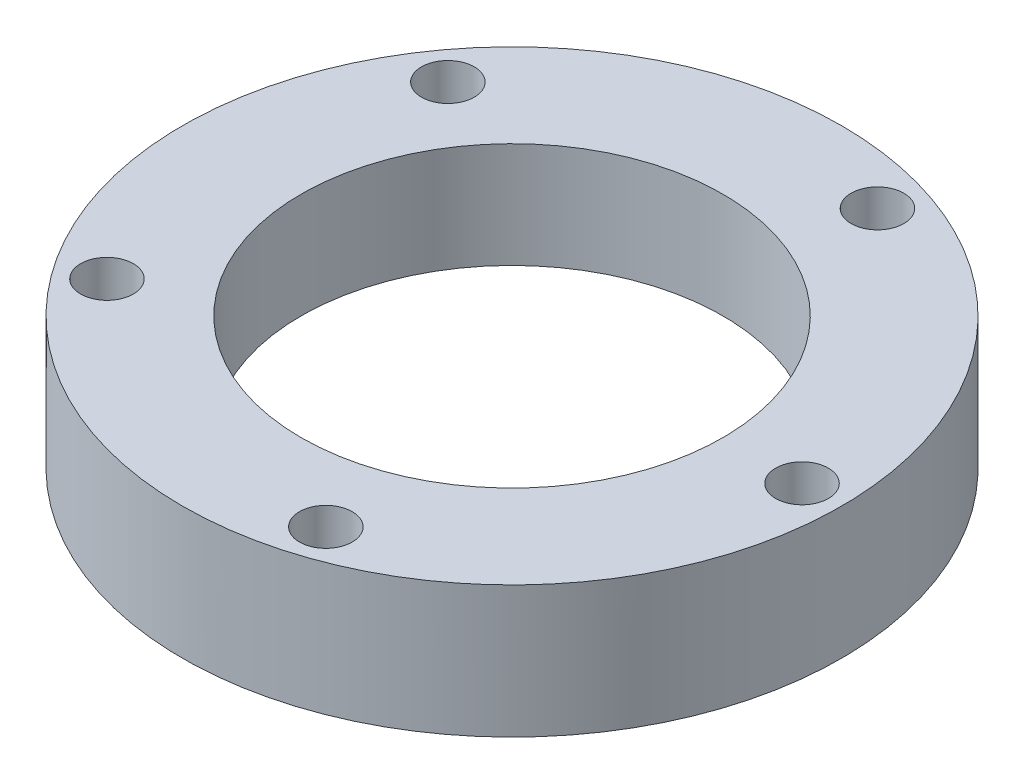
ISO-10303-21;
HEADER;
FILE_DESCRIPTION(('STEP AP214'),'2;1');
FILE_NAME('part.step','',(''),(''),'','','');
FILE_SCHEMA(('AUTOMOTIVE_DESIGN { 1 0 10303 214 1 1 1 1 }'));
ENDSEC;
DATA;
#1=APPLICATION_CONTEXT('core data for automotive mechanical design processes');
#2=APPLICATION_PROTOCOL_DEFINITION('international standard','automotive_design',2000,#1);
#3=PRODUCT_CONTEXT('',#1,'mechanical');
#4=PRODUCT('Part','Part','',(#3));
#5=PRODUCT_RELATED_PRODUCT_CATEGORY('part','',(#4));
#6=PRODUCT_DEFINITION_FORMATION('','',#4);
#7=PRODUCT_DEFINITION_CONTEXT('part definition',#1,'design');
#8=PRODUCT_DEFINITION('design','',#6,#7);
#9=PRODUCT_DEFINITION_SHAPE('','',#8);
#10=(LENGTH_UNIT() NAMED_UNIT(*) SI_UNIT(.MILLI.,.METRE.));
#11=(NAMED_UNIT(*) PLANE_ANGLE_UNIT() SI_UNIT($,.RADIAN.));
#12=(NAMED_UNIT(*) SI_UNIT($,.STERADIAN.) SOLID_ANGLE_UNIT());
#13=UNCERTAINTY_MEASURE_WITH_UNIT(LENGTH_MEASURE(1.E-05),#10,'distance_accuracy_value','');
#14=(GEOMETRIC_REPRESENTATION_CONTEXT(3) GLOBAL_UNCERTAINTY_ASSIGNED_CONTEXT((#13)) GLOBAL_UNIT_ASSIGNED_CONTEXT((#10,
#11,#12)) REPRESENTATION_CONTEXT('',''));
#15=CARTESIAN_POINT('',(0.,0.,0.));
#16=DIRECTION('',(0.,0.,1.));
#17=DIRECTION('',(1.,0.,0.));
#18=AXIS2_PLACEMENT_3D('',#15,#16,#17);
#19=CARTESIAN_POINT('',(0.,0.,0.));
#20=DIRECTION('',(0.,1.,0.));
#21=DIRECTION('',(0.,0.,1.));
#22=AXIS2_PLACEMENT_3D('',#19,#20,#21);
#23=PLANE('',#22);
#24=CARTESIAN_POINT('',(0.,0.,0.));
#25=DIRECTION('',(0.,1.,0.));
#26=DIRECTION('',(0.,0.,1.));
#27=AXIS2_PLACEMENT_3D('',#24,#25,#26);
#28=CIRCLE('',#27,8.);
#29=CARTESIAN_POINT('',(0.,0.,8.));
#30=VERTEX_POINT('',#29);
#31=EDGE_CURVE('E41',#30,#30,#28,.T.);
#32=ORIENTED_EDGE('',*,*,#31,.T.);
#33=EDGE_LOOP('',(#32));
#34=FACE_BOUND('',#33,.T.);
#35=CARTESIAN_POINT('',(0.,0.,0.));
#36=DIRECTION('',(0.,-1.,0.));
#37=DIRECTION('',(0.,0.,-1.));
#38=AXIS2_PLACEMENT_3D('',#35,#36,#37);
#39=CIRCLE('',#38,9.6);
#40=CARTESIAN_POINT('',(0.,0.,-9.6));
#41=VERTEX_POINT('',#40);
#42=EDGE_CURVE('E98',#41,#41,#39,.T.);
#43=ORIENTED_EDGE('',*,*,#42,.T.);
#44=EDGE_LOOP('',(#43));
#45=FACE_BOUND('',#44,.T.);
#46=ADVANCED_FACE('F37',(#34,#45),#23,.F.);
#47=CARTESIAN_POINT('',(0.,4.,0.));
#48=DIRECTION('',(0.,-1.,0.));
#49=DIRECTION('',(0.,0.,-1.));
#50=AXIS2_PLACEMENT_3D('',#47,#48,#49);
#51=CYLINDRICAL_SURFACE('',#50,12.5);
#52=CARTESIAN_POINT('',(0.,4.,0.));
#53=DIRECTION('',(0.,1.,0.));
#54=DIRECTION('',(0.,0.,1.));
#55=AXIS2_PLACEMENT_3D('',#52,#53,#54);
#56=CIRCLE('',#55,12.5);
#57=CARTESIAN_POINT('',(0.,4.,12.5));
#58=VERTEX_POINT('',#57);
#59=EDGE_CURVE('E10',#58,#58,#56,.T.);
#60=ORIENTED_EDGE('',*,*,#59,.F.);
#61=EDGE_LOOP('',(#60));
#62=FACE_BOUND('',#61,.T.);
#63=CARTESIAN_POINT('',(0.,-1.,0.));
#64=DIRECTION('',(0.,-1.,0.));
#65=DIRECTION('',(0.,0.,-1.));
#66=AXIS2_PLACEMENT_3D('',#63,#64,#65);
#67=CIRCLE('',#66,12.5);
#68=CARTESIAN_POINT('',(0.,-1.,-12.5));
#69=VERTEX_POINT('',#68);
#70=EDGE_CURVE('E93',#69,#69,#67,.T.);
#71=ORIENTED_EDGE('',*,*,#70,.F.);
#72=EDGE_LOOP('',(#71));
#73=FACE_BOUND('',#72,.T.);
#74=ADVANCED_FACE('F39',(#62,#73),#51,.T.);
#75=CARTESIAN_POINT('',(0.,4.,0.));
#76=DIRECTION('',(0.,1.,0.));
#77=DIRECTION('',(0.,0.,1.));
#78=AXIS2_PLACEMENT_3D('',#75,#76,#77);
#79=PLANE('',#78);
#80=CARTESIAN_POINT('',(0.,4.,0.));
#81=DIRECTION('',(0.,1.,0.));
#82=DIRECTION('',(0.,0.,1.));
#83=AXIS2_PLACEMENT_3D('',#80,#81,#82);
#84=CIRCLE('',#83,8.);
#85=CARTESIAN_POINT('',(0.,4.,8.));
#86=VERTEX_POINT('',#85);
#87=EDGE_CURVE('E89',#86,#86,#84,.T.);
#88=ORIENTED_EDGE('',*,*,#87,.F.);
#89=EDGE_LOOP('',(#88));
#90=FACE_BOUND('',#89,.T.);
#91=CARTESIAN_POINT('',(3.39918693812454,4.,-10.4616216792467));
#92=DIRECTION('',(0.,1.,0.));
#93=DIRECTION('',(0.,0.,1.));
#94=AXIS2_PLACEMENT_3D('',#91,#92,#93);
#95=CIRCLE('',#94,1.);
#96=CARTESIAN_POINT('',(3.39918693812454,4.,-9.46162167924665));
#97=VERTEX_POINT('',#96);
#98=EDGE_CURVE('E65',#97,#97,#95,.T.);
#99=ORIENTED_EDGE('',*,*,#98,.F.);
#100=EDGE_LOOP('',(#99));
#101=FACE_BOUND('',#100,.T.);
#102=CARTESIAN_POINT('',(-8.89918693812437,4.,-6.46563777521728));
#103=DIRECTION('',(0.,1.,0.));
#104=DIRECTION('',(0.,0.,1.));
#105=AXIS2_PLACEMENT_3D('',#102,#103,#104);
#106=CIRCLE('',#105,1.);
#107=CARTESIAN_POINT('',(-8.89918693812437,4.,-5.46563777521728));
#108=VERTEX_POINT('',#107);
#109=EDGE_CURVE('E61',#108,#108,#106,.T.);
#110=ORIENTED_EDGE('',*,*,#109,.F.);
#111=EDGE_LOOP('',(#110));
#112=FACE_BOUND('',#111,.T.);
#113=CARTESIAN_POINT('',(-8.89918693812446,4.,6.46563777521715));
#114=DIRECTION('',(0.,1.,0.));
#115=DIRECTION('',(0.,0.,1.));
#116=AXIS2_PLACEMENT_3D('',#113,#114,#115);
#117=CIRCLE('',#116,1.);
#118=CARTESIAN_POINT('',(-8.89918693812446,4.,7.46563777521716));
#119=VERTEX_POINT('',#118);
#120=EDGE_CURVE('E57',#119,#119,#117,.T.);
#121=ORIENTED_EDGE('',*,*,#120,.F.);
#122=EDGE_LOOP('',(#121));
#123=FACE_BOUND('',#122,.T.);
#124=CARTESIAN_POINT('',(3.39918693812439,4.,10.4616216792467));
#125=DIRECTION('',(0.,1.,0.));
#126=DIRECTION('',(0.,0.,1.));
#127=AXIS2_PLACEMENT_3D('',#124,#125,#126);
#128=CIRCLE('',#127,1.);
#129=CARTESIAN_POINT('',(3.39918693812439,4.,11.4616216792467));
#130=VERTEX_POINT('',#129);
#131=EDGE_CURVE('E51',#130,#130,#128,.T.);
#132=ORIENTED_EDGE('',*,*,#131,.F.);
#133=EDGE_LOOP('',(#132));
#134=FACE_BOUND('',#133,.T.);
#135=CARTESIAN_POINT('',(11.,4.,0.));
#136=DIRECTION('',(0.,1.,0.));
#137=DIRECTION('',(0.,0.,1.));
#138=AXIS2_PLACEMENT_3D('',#135,#136,#137);
#139=CIRCLE('',#138,1.);
#140=CARTESIAN_POINT('',(11.,4.,1.));
#141=VERTEX_POINT('',#140);
#142=EDGE_CURVE('E46',#141,#141,#139,.T.);
#143=ORIENTED_EDGE('',*,*,#142,.F.);
#144=EDGE_LOOP('',(#143));
#145=FACE_BOUND('',#144,.T.);
#146=ORIENTED_EDGE('',*,*,#59,.T.);
#147=EDGE_LOOP('',(#146));
#148=FACE_BOUND('',#147,.T.);
#149=ADVANCED_FACE('F131',(#90,#101,#112,#123,#134,#145,#148),#79,.T.);
#150=CARTESIAN_POINT('',(-8.89918693812446,0.,6.46563777521715));
#151=DIRECTION('',(0.,1.,0.));
#152=DIRECTION('',(0.,0.,1.));
#153=AXIS2_PLACEMENT_3D('',#150,#151,#152);
#154=CYLINDRICAL_SURFACE('',#153,1.);
#155=ORIENTED_EDGE('',*,*,#120,.T.);
#156=EDGE_LOOP('',(#155));
#157=FACE_BOUND('',#156,.T.);
#158=CARTESIAN_POINT('',(-8.89918693812446,0.,6.46563777521715));
#159=DIRECTION('',(0.,1.,0.));
#160=DIRECTION('',(0.,0.,1.));
#161=AXIS2_PLACEMENT_3D('',#158,#159,#160);
#162=CIRCLE('',#161,1.);
#163=CARTESIAN_POINT('',(-8.89918693812446,0.,7.46563777521716));
#164=VERTEX_POINT('',#163);
#165=EDGE_CURVE('E69',#164,#164,#162,.T.);
#166=ORIENTED_EDGE('',*,*,#165,.F.);
#167=EDGE_LOOP('',(#166));
#168=FACE_BOUND('',#167,.T.);
#169=ADVANCED_FACE('F138',(#157,#168),#154,.F.);
#170=CARTESIAN_POINT('',(3.39918693812439,0.,10.4616216792467));
#171=DIRECTION('',(0.,1.,0.));
#172=DIRECTION('',(0.,0.,1.));
#173=AXIS2_PLACEMENT_3D('',#170,#171,#172);
#174=CYLINDRICAL_SURFACE('',#173,1.);
#175=ORIENTED_EDGE('',*,*,#131,.T.);
#176=EDGE_LOOP('',(#175));
#177=FACE_BOUND('',#176,.T.);
#178=CARTESIAN_POINT('',(3.39918693812439,0.,10.4616216792467));
#179=DIRECTION('',(0.,1.,0.));
#180=DIRECTION('',(0.,0.,1.));
#181=AXIS2_PLACEMENT_3D('',#178,#179,#180);
#182=CIRCLE('',#181,1.);
#183=CARTESIAN_POINT('',(3.39918693812439,0.,11.4616216792467));
#184=VERTEX_POINT('',#183);
#185=EDGE_CURVE('E73',#184,#184,#182,.T.);
#186=ORIENTED_EDGE('',*,*,#185,.F.);
#187=EDGE_LOOP('',(#186));
#188=FACE_BOUND('',#187,.T.);
#189=ADVANCED_FACE('F142',(#177,#188),#174,.F.);
#190=CARTESIAN_POINT('',(11.,0.,0.));
#191=DIRECTION('',(0.,1.,0.));
#192=DIRECTION('',(0.,0.,1.));
#193=AXIS2_PLACEMENT_3D('',#190,#191,#192);
#194=CYLINDRICAL_SURFACE('',#193,1.);
#195=ORIENTED_EDGE('',*,*,#142,.T.);
#196=EDGE_LOOP('',(#195));
#197=FACE_BOUND('',#196,.T.);
#198=CARTESIAN_POINT('',(11.,0.,0.));
#199=DIRECTION('',(0.,1.,0.));
#200=DIRECTION('',(0.,0.,1.));
#201=AXIS2_PLACEMENT_3D('',#198,#199,#200);
#202=CIRCLE('',#201,1.);
#203=CARTESIAN_POINT('',(11.,0.,1.));
#204=VERTEX_POINT('',#203);
#205=EDGE_CURVE('E82',#204,#204,#202,.T.);
#206=ORIENTED_EDGE('',*,*,#205,.F.);
#207=EDGE_LOOP('',(#206));
#208=FACE_BOUND('',#207,.T.);
#209=ADVANCED_FACE('F151',(#197,#208),#194,.F.);
#210=CARTESIAN_POINT('',(3.39918693812454,0.,-10.4616216792467));
#211=DIRECTION('',(0.,1.,0.));
#212=DIRECTION('',(0.,0.,1.));
#213=AXIS2_PLACEMENT_3D('',#210,#211,#212);
#214=CYLINDRICAL_SURFACE('',#213,1.);
#215=ORIENTED_EDGE('',*,*,#98,.T.);
#216=EDGE_LOOP('',(#215));
#217=FACE_BOUND('',#216,.T.);
#218=CARTESIAN_POINT('',(3.39918693812454,0.,-10.4616216792467));
#219=DIRECTION('',(0.,1.,0.));
#220=DIRECTION('',(0.,0.,1.));
#221=AXIS2_PLACEMENT_3D('',#218,#219,#220);
#222=CIRCLE('',#221,1.);
#223=CARTESIAN_POINT('',(3.39918693812454,0.,-9.46162167924665));
#224=VERTEX_POINT('',#223);
#225=EDGE_CURVE('E78',#224,#224,#222,.T.);
#226=ORIENTED_EDGE('',*,*,#225,.F.);
#227=EDGE_LOOP('',(#226));
#228=FACE_BOUND('',#227,.T.);
#229=ADVANCED_FACE('F147',(#217,#228),#214,.F.);
#230=CARTESIAN_POINT('',(-8.89918693812437,0.,-6.46563777521728));
#231=DIRECTION('',(0.,1.,0.));
#232=DIRECTION('',(0.,0.,1.));
#233=AXIS2_PLACEMENT_3D('',#230,#231,#232);
#234=CYLINDRICAL_SURFACE('',#233,1.);
#235=ORIENTED_EDGE('',*,*,#109,.T.);
#236=EDGE_LOOP('',(#235));
#237=FACE_BOUND('',#236,.T.);
#238=CARTESIAN_POINT('',(-8.89918693812437,0.,-6.46563777521728));
#239=DIRECTION('',(0.,1.,0.));
#240=DIRECTION('',(0.,0.,1.));
#241=AXIS2_PLACEMENT_3D('',#238,#239,#240);
#242=CIRCLE('',#241,1.);
#243=CARTESIAN_POINT('',(-8.89918693812437,0.,-5.46563777521728));
#244=VERTEX_POINT('',#243);
#245=EDGE_CURVE('E74',#244,#244,#242,.T.);
#246=ORIENTED_EDGE('',*,*,#245,.F.);
#247=EDGE_LOOP('',(#246));
#248=FACE_BOUND('',#247,.T.);
#249=ADVANCED_FACE('F144',(#237,#248),#234,.F.);
#250=CARTESIAN_POINT('',(0.,-6.,0.));
#251=DIRECTION('',(0.,1.,0.));
#252=DIRECTION('',(0.,0.,1.));
#253=AXIS2_PLACEMENT_3D('',#250,#251,#252);
#254=CYLINDRICAL_SURFACE('',#253,8.);
#255=ORIENTED_EDGE('',*,*,#87,.T.);
#256=EDGE_LOOP('',(#255));
#257=FACE_BOUND('',#256,.T.);
#258=ORIENTED_EDGE('',*,*,#31,.F.);
#259=EDGE_LOOP('',(#258));
#260=FACE_BOUND('',#259,.T.);
#261=ADVANCED_FACE('F122',(#257,#260),#254,.F.);
#262=CARTESIAN_POINT('',(0.,-1.,0.));
#263=DIRECTION('',(0.,1.,0.));
#264=DIRECTION('',(0.,0.,1.));
#265=AXIS2_PLACEMENT_3D('',#262,#263,#264);
#266=CYLINDRICAL_SURFACE('',#265,9.6);
#267=CARTESIAN_POINT('',(0.,-1.,0.));
#268=DIRECTION('',(0.,-1.,0.));
#269=DIRECTION('',(0.,0.,-1.));
#270=AXIS2_PLACEMENT_3D('',#267,#268,#269);
#271=CIRCLE('',#270,9.6);
#272=CARTESIAN_POINT('',(0.,-1.,-9.6));
#273=VERTEX_POINT('',#272);
#274=EDGE_CURVE('E97',#273,#273,#271,.T.);
#275=ORIENTED_EDGE('',*,*,#274,.T.);
#276=EDGE_LOOP('',(#275));
#277=FACE_BOUND('',#276,.T.);
#278=ORIENTED_EDGE('',*,*,#42,.F.);
#279=EDGE_LOOP('',(#278));
#280=FACE_BOUND('',#279,.T.);
#281=ADVANCED_FACE('F106',(#277,#280),#266,.F.);
#282=CARTESIAN_POINT('',(0.,-1.,0.));
#283=DIRECTION('',(0.,-1.,0.));
#284=DIRECTION('',(0.,0.,-1.));
#285=AXIS2_PLACEMENT_3D('',#282,#283,#284);
#286=PLANE('',#285);
#287=ORIENTED_EDGE('',*,*,#70,.T.);
#288=EDGE_LOOP('',(#287));
#289=FACE_BOUND('',#288,.T.);
#290=ORIENTED_EDGE('',*,*,#274,.F.);
#291=EDGE_LOOP('',(#290));
#292=FACE_BOUND('',#291,.T.);
#293=ADVANCED_FACE('F109',(#289,#292),#286,.T.);
#294=CARTESIAN_POINT('',(0.,0.,0.));
#295=DIRECTION('',(0.,-1.,0.));
#296=DIRECTION('',(0.,0.,-1.));
#297=AXIS2_PLACEMENT_3D('',#294,#295,#296);
#298=PLANE('',#297);
#299=ORIENTED_EDGE('',*,*,#165,.T.);
#300=EDGE_LOOP('',(#299));
#301=FACE_BOUND('',#300,.T.);
#302=ADVANCED_FACE('F111',(#301),#298,.F.);
#303=ORIENTED_EDGE('',*,*,#185,.T.);
#304=EDGE_LOOP('',(#303));
#305=FACE_BOUND('',#304,.T.);
#306=ADVANCED_FACE('F118',(#305),#298,.F.);
#307=ORIENTED_EDGE('',*,*,#205,.T.);
#308=EDGE_LOOP('',(#307));
#309=FACE_BOUND('',#308,.T.);
#310=ADVANCED_FACE('F167',(#309),#298,.F.);
#311=ORIENTED_EDGE('',*,*,#225,.T.);
#312=EDGE_LOOP('',(#311));
#313=FACE_BOUND('',#312,.T.);
#314=ADVANCED_FACE('F162',(#313),#298,.F.);
#315=ORIENTED_EDGE('',*,*,#245,.T.);
#316=EDGE_LOOP('',(#315));
#317=FACE_BOUND('',#316,.T.);
#318=ADVANCED_FACE('F121',(#317),#298,.F.);
#319=CLOSED_SHELL('',(#46,#74,#149,#169,#189,#209,#229,#249,#261,#281,#293,#302,#306,#310,#314,#318));
#320=MANIFOLD_SOLID_BREP('B2',#319);
#321=ADVANCED_BREP_SHAPE_REPRESENTATION('',(#18,#320),#14);
#322=SHAPE_DEFINITION_REPRESENTATION(#9,#321);
ENDSEC;
END-ISO-10303-21;
